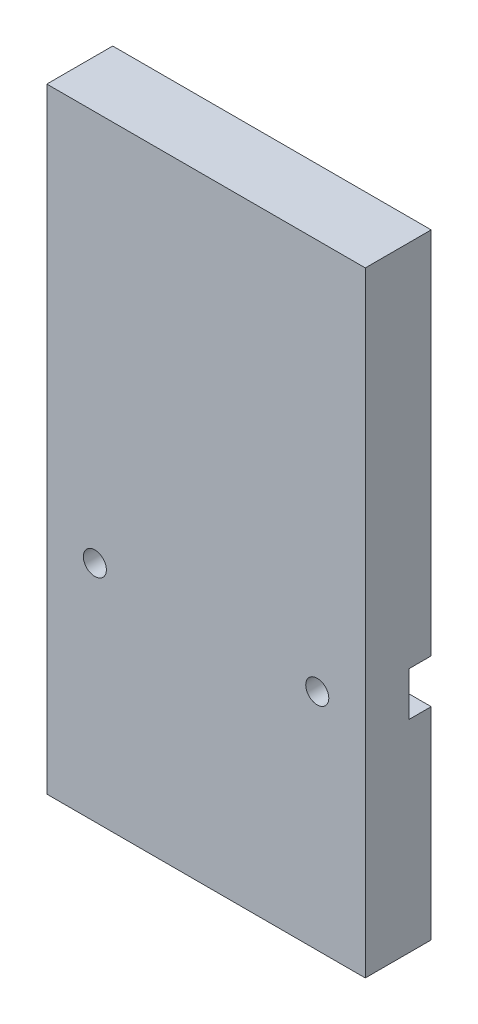
ISO-10303-21;
HEADER;
FILE_DESCRIPTION(('STEP AP214'),'2;1');
FILE_NAME('part.step','',(''),(''),'','','');
FILE_SCHEMA(('AUTOMOTIVE_DESIGN { 1 0 10303 214 1 1 1 1 }'));
ENDSEC;
DATA;
#1=APPLICATION_CONTEXT('core data for automotive mechanical design processes');
#2=APPLICATION_PROTOCOL_DEFINITION('international standard','automotive_design',2000,#1);
#3=PRODUCT_CONTEXT('',#1,'mechanical');
#4=PRODUCT('Part','Part','',(#3));
#5=PRODUCT_RELATED_PRODUCT_CATEGORY('part','',(#4));
#6=PRODUCT_DEFINITION_FORMATION('','',#4);
#7=PRODUCT_DEFINITION_CONTEXT('part definition',#1,'design');
#8=PRODUCT_DEFINITION('design','',#6,#7);
#9=PRODUCT_DEFINITION_SHAPE('','',#8);
#10=(LENGTH_UNIT() NAMED_UNIT(*) SI_UNIT(.MILLI.,.METRE.));
#11=(NAMED_UNIT(*) PLANE_ANGLE_UNIT() SI_UNIT($,.RADIAN.));
#12=(NAMED_UNIT(*) SI_UNIT($,.STERADIAN.) SOLID_ANGLE_UNIT());
#13=UNCERTAINTY_MEASURE_WITH_UNIT(LENGTH_MEASURE(1.E-05),#10,'distance_accuracy_value','');
#14=(GEOMETRIC_REPRESENTATION_CONTEXT(3) GLOBAL_UNCERTAINTY_ASSIGNED_CONTEXT((#13)) GLOBAL_UNIT_ASSIGNED_CONTEXT((#10,
#11,#12)) REPRESENTATION_CONTEXT('',''));
#15=CARTESIAN_POINT('',(0.,0.,0.));
#16=DIRECTION('',(0.,0.,1.));
#17=DIRECTION('',(1.,0.,0.));
#18=AXIS2_PLACEMENT_3D('',#15,#16,#17);
#19=CARTESIAN_POINT('',(0.,355.6,0.));
#20=DIRECTION('',(1.,0.,0.));
#21=DIRECTION('',(0.,0.,-1.));
#22=AXIS2_PLACEMENT_3D('',#19,#20,#21);
#23=PLANE('',#22);
#24=DIRECTION('',(0.,0.,-1.));
#25=VECTOR('',#24,1.);
#26=CARTESIAN_POINT('',(0.,116.84,-25.4));
#27=LINE('',#26,#25);
#28=CARTESIAN_POINT('',(0.,116.84,-25.4));
#29=VERTEX_POINT('',#28);
#30=CARTESIAN_POINT('',(0.,116.84,-38.1));
#31=VERTEX_POINT('',#30);
#32=EDGE_CURVE('E234',#29,#31,#27,.T.);
#33=ORIENTED_EDGE('',*,*,#32,.T.);
#34=DIRECTION('',(0.,-1.,0.));
#35=VECTOR('',#34,1.);
#36=CARTESIAN_POINT('',(0.,355.6,-38.1));
#37=LINE('',#36,#35);
#38=CARTESIAN_POINT('',(0.,0.,-38.1));
#39=VERTEX_POINT('',#38);
#40=EDGE_CURVE('E98',#31,#39,#37,.T.);
#41=ORIENTED_EDGE('',*,*,#40,.T.);
#42=DIRECTION('',(0.,0.,1.));
#43=VECTOR('',#42,1.);
#44=CARTESIAN_POINT('',(0.,0.,0.));
#45=LINE('',#44,#43);
#46=CARTESIAN_POINT('',(0.,0.,0.));
#47=VERTEX_POINT('',#46);
#48=EDGE_CURVE('E236',#39,#47,#45,.T.);
#49=ORIENTED_EDGE('',*,*,#48,.T.);
#50=DIRECTION('',(0.,-1.,0.));
#51=VECTOR('',#50,1.);
#52=CARTESIAN_POINT('',(0.,355.6,0.));
#53=LINE('',#52,#51);
#54=CARTESIAN_POINT('',(0.,355.6,0.));
#55=VERTEX_POINT('',#54);
#56=EDGE_CURVE('E11',#55,#47,#53,.T.);
#57=ORIENTED_EDGE('',*,*,#56,.F.);
#58=DIRECTION('',(0.,0.,1.));
#59=VECTOR('',#58,1.);
#60=CARTESIAN_POINT('',(0.,355.6,0.));
#61=LINE('',#60,#59);
#62=CARTESIAN_POINT('',(0.,355.6,-38.1));
#63=VERTEX_POINT('',#62);
#64=EDGE_CURVE('E237',#63,#55,#61,.T.);
#65=ORIENTED_EDGE('',*,*,#64,.F.);
#66=CARTESIAN_POINT('',(0.,142.24,-38.1));
#67=VERTEX_POINT('',#66);
#68=EDGE_CURVE('E251',#63,#67,#37,.T.);
#69=ORIENTED_EDGE('',*,*,#68,.T.);
#70=DIRECTION('',(0.,0.,-1.));
#71=VECTOR('',#70,1.);
#72=CARTESIAN_POINT('',(0.,142.24,-25.4));
#73=LINE('',#72,#71);
#74=CARTESIAN_POINT('',(0.,142.24,-25.4));
#75=VERTEX_POINT('',#74);
#76=EDGE_CURVE('E67',#75,#67,#73,.T.);
#77=ORIENTED_EDGE('',*,*,#76,.F.);
#78=DIRECTION('',(0.,-1.,0.));
#79=VECTOR('',#78,1.);
#80=CARTESIAN_POINT('',(0.,116.84,-25.4));
#81=LINE('',#80,#79);
#82=EDGE_CURVE('E213',#75,#29,#81,.T.);
#83=ORIENTED_EDGE('',*,*,#82,.T.);
#84=EDGE_LOOP('',(#33,#41,#49,#57,#65,#69,#77,#83));
#85=FACE_BOUND('',#84,.T.);
#86=ADVANCED_FACE('F51',(#85),#23,.F.);
#87=CARTESIAN_POINT('',(184.15,355.6,0.));
#88=DIRECTION('',(-1.,0.,0.));
#89=DIRECTION('',(0.,0.,1.));
#90=AXIS2_PLACEMENT_3D('',#87,#88,#89);
#91=PLANE('',#90);
#92=DIRECTION('',(0.,0.,-1.));
#93=VECTOR('',#92,1.);
#94=CARTESIAN_POINT('',(184.15,116.84,-25.4));
#95=LINE('',#94,#93);
#96=CARTESIAN_POINT('',(184.15,116.84,-25.4));
#97=VERTEX_POINT('',#96);
#98=CARTESIAN_POINT('',(184.15,116.84,-38.1));
#99=VERTEX_POINT('',#98);
#100=EDGE_CURVE('E232',#97,#99,#95,.T.);
#101=ORIENTED_EDGE('',*,*,#100,.F.);
#102=DIRECTION('',(0.,1.,0.));
#103=VECTOR('',#102,1.);
#104=CARTESIAN_POINT('',(184.15,116.84,-25.4));
#105=LINE('',#104,#103);
#106=CARTESIAN_POINT('',(184.15,142.24,-25.4));
#107=VERTEX_POINT('',#106);
#108=EDGE_CURVE('E219',#97,#107,#105,.T.);
#109=ORIENTED_EDGE('',*,*,#108,.T.);
#110=DIRECTION('',(0.,0.,-1.));
#111=VECTOR('',#110,1.);
#112=CARTESIAN_POINT('',(184.15,142.24,-25.4));
#113=LINE('',#112,#111);
#114=CARTESIAN_POINT('',(184.15,142.24,-38.1));
#115=VERTEX_POINT('',#114);
#116=EDGE_CURVE('E229',#107,#115,#113,.T.);
#117=ORIENTED_EDGE('',*,*,#116,.T.);
#118=DIRECTION('',(0.,-1.,0.));
#119=VECTOR('',#118,1.);
#120=CARTESIAN_POINT('',(184.15,355.6,-38.1));
#121=LINE('',#120,#119);
#122=CARTESIAN_POINT('',(184.15,355.6,-38.1));
#123=VERTEX_POINT('',#122);
#124=EDGE_CURVE('E255',#123,#115,#121,.T.);
#125=ORIENTED_EDGE('',*,*,#124,.F.);
#126=DIRECTION('',(0.,0.,-1.));
#127=VECTOR('',#126,1.);
#128=CARTESIAN_POINT('',(184.15,355.6,0.));
#129=LINE('',#128,#127);
#130=CARTESIAN_POINT('',(184.15,355.6,0.));
#131=VERTEX_POINT('',#130);
#132=EDGE_CURVE('E241',#131,#123,#129,.T.);
#133=ORIENTED_EDGE('',*,*,#132,.F.);
#134=DIRECTION('',(0.,-1.,0.));
#135=VECTOR('',#134,1.);
#136=CARTESIAN_POINT('',(184.15,355.6,0.));
#137=LINE('',#136,#135);
#138=CARTESIAN_POINT('',(184.15,0.,0.));
#139=VERTEX_POINT('',#138);
#140=EDGE_CURVE('E59',#131,#139,#137,.T.);
#141=ORIENTED_EDGE('',*,*,#140,.T.);
#142=DIRECTION('',(0.,0.,-1.));
#143=VECTOR('',#142,1.);
#144=CARTESIAN_POINT('',(184.15,0.,0.));
#145=LINE('',#144,#143);
#146=CARTESIAN_POINT('',(184.15,0.,-38.1));
#147=VERTEX_POINT('',#146);
#148=EDGE_CURVE('E247',#139,#147,#145,.T.);
#149=ORIENTED_EDGE('',*,*,#148,.T.);
#150=EDGE_CURVE('E254',#99,#147,#121,.T.);
#151=ORIENTED_EDGE('',*,*,#150,.F.);
#152=EDGE_LOOP('',(#101,#109,#117,#125,#133,#141,#149,#151));
#153=FACE_BOUND('',#152,.T.);
#154=ADVANCED_FACE('F286',(#153),#91,.F.);
#155=CARTESIAN_POINT('',(0.,355.6,-38.1));
#156=DIRECTION('',(0.,0.,1.));
#157=DIRECTION('',(1.,0.,0.));
#158=AXIS2_PLACEMENT_3D('',#155,#156,#157);
#159=PLANE('',#158);
#160=DIRECTION('',(1.,0.,0.));
#161=VECTOR('',#160,1.);
#162=CARTESIAN_POINT('',(0.,116.84,-38.1));
#163=LINE('',#162,#161);
#164=EDGE_CURVE('E224',#31,#99,#163,.T.);
#165=ORIENTED_EDGE('',*,*,#164,.T.);
#166=ORIENTED_EDGE('',*,*,#150,.T.);
#167=DIRECTION('',(-1.,0.,0.));
#168=VECTOR('',#167,1.);
#169=CARTESIAN_POINT('',(0.,0.,-38.1));
#170=LINE('',#169,#168);
#171=EDGE_CURVE('E239',#147,#39,#170,.T.);
#172=ORIENTED_EDGE('',*,*,#171,.T.);
#173=ORIENTED_EDGE('',*,*,#40,.F.);
#174=EDGE_LOOP('',(#165,#166,#172,#173));
#175=FACE_BOUND('',#174,.T.);
#176=ADVANCED_FACE('F292',(#175),#159,.F.);
#177=DIRECTION('',(-1.,0.,0.));
#178=VECTOR('',#177,1.);
#179=CARTESIAN_POINT('',(0.,142.24,-38.1));
#180=LINE('',#179,#178);
#181=EDGE_CURVE('E217',#115,#67,#180,.T.);
#182=ORIENTED_EDGE('',*,*,#181,.T.);
#183=ORIENTED_EDGE('',*,*,#68,.F.);
#184=DIRECTION('',(-1.,0.,0.));
#185=VECTOR('',#184,1.);
#186=CARTESIAN_POINT('',(0.,355.6,-38.1));
#187=LINE('',#186,#185);
#188=EDGE_CURVE('E76',#123,#63,#187,.T.);
#189=ORIENTED_EDGE('',*,*,#188,.F.);
#190=ORIENTED_EDGE('',*,*,#124,.T.);
#191=EDGE_LOOP('',(#182,#183,#189,#190));
#192=FACE_BOUND('',#191,.T.);
#193=ADVANCED_FACE('F282',(#192),#159,.F.);
#194=CARTESIAN_POINT('',(0.,355.6,0.));
#195=DIRECTION('',(0.,0.,-1.));
#196=DIRECTION('',(-1.,0.,0.));
#197=AXIS2_PLACEMENT_3D('',#194,#195,#196);
#198=PLANE('',#197);
#199=CARTESIAN_POINT('',(156.37405606,129.54,0.));
#200=DIRECTION('',(0.,0.,-1.));
#201=DIRECTION('',(-1.,0.,0.));
#202=AXIS2_PLACEMENT_3D('',#199,#200,#201);
#203=CIRCLE('',#202,6.6675);
#204=CARTESIAN_POINT('',(149.70655606,129.54,0.));
#205=VERTEX_POINT('',#204);
#206=EDGE_CURVE('E207',#205,#205,#203,.T.);
#207=ORIENTED_EDGE('',*,*,#206,.T.);
#208=EDGE_LOOP('',(#207));
#209=FACE_BOUND('',#208,.T.);
#210=CARTESIAN_POINT('',(27.77594394,129.54,0.));
#211=DIRECTION('',(0.,0.,-1.));
#212=DIRECTION('',(-1.,0.,0.));
#213=AXIS2_PLACEMENT_3D('',#210,#211,#212);
#214=CIRCLE('',#213,6.66749999999999);
#215=CARTESIAN_POINT('',(21.10844394,129.54,0.));
#216=VERTEX_POINT('',#215);
#217=EDGE_CURVE('E206',#216,#216,#214,.T.);
#218=ORIENTED_EDGE('',*,*,#217,.T.);
#219=EDGE_LOOP('',(#218));
#220=FACE_BOUND('',#219,.T.);
#221=DIRECTION('',(1.,0.,0.));
#222=VECTOR('',#221,1.);
#223=CARTESIAN_POINT('',(0.,0.,0.));
#224=LINE('',#223,#222);
#225=EDGE_CURVE('E245',#47,#139,#224,.T.);
#226=ORIENTED_EDGE('',*,*,#225,.T.);
#227=ORIENTED_EDGE('',*,*,#140,.F.);
#228=DIRECTION('',(1.,0.,0.));
#229=VECTOR('',#228,1.);
#230=CARTESIAN_POINT('',(0.,355.6,0.));
#231=LINE('',#230,#229);
#232=EDGE_CURVE('E105',#55,#131,#231,.T.);
#233=ORIENTED_EDGE('',*,*,#232,.F.);
#234=ORIENTED_EDGE('',*,*,#56,.T.);
#235=EDGE_LOOP('',(#226,#227,#233,#234));
#236=FACE_BOUND('',#235,.T.);
#237=ADVANCED_FACE('F298',(#209,#220,#236),#198,.F.);
#238=CARTESIAN_POINT('',(0.,355.6,0.));
#239=DIRECTION('',(0.,-1.,0.));
#240=DIRECTION('',(0.,0.,-1.));
#241=AXIS2_PLACEMENT_3D('',#238,#239,#240);
#242=PLANE('',#241);
#243=ORIENTED_EDGE('',*,*,#64,.T.);
#244=ORIENTED_EDGE('',*,*,#232,.T.);
#245=ORIENTED_EDGE('',*,*,#132,.T.);
#246=ORIENTED_EDGE('',*,*,#188,.T.);
#247=EDGE_LOOP('',(#243,#244,#245,#246));
#248=FACE_BOUND('',#247,.T.);
#249=ADVANCED_FACE('F299',(#248),#242,.F.);
#250=CARTESIAN_POINT('',(0.,0.,0.));
#251=DIRECTION('',(0.,-1.,0.));
#252=DIRECTION('',(0.,0.,-1.));
#253=AXIS2_PLACEMENT_3D('',#250,#251,#252);
#254=PLANE('',#253);
#255=CARTESIAN_POINT('',(12.7,0.,-19.05));
#256=DIRECTION('',(0.,-1.,0.));
#257=DIRECTION('',(0.,0.,-1.));
#258=AXIS2_PLACEMENT_3D('',#255,#256,#257);
#259=CIRCLE('',#258,2.45744999999999);
#260=CARTESIAN_POINT('',(12.7,0.,-21.50745));
#261=VERTEX_POINT('',#260);
#262=EDGE_CURVE('E160',#261,#261,#259,.T.);
#263=ORIENTED_EDGE('',*,*,#262,.F.);
#264=EDGE_LOOP('',(#263));
#265=FACE_BOUND('',#264,.T.);
#266=CARTESIAN_POINT('',(35.3785714285715,0.,-19.05));
#267=DIRECTION('',(0.,-1.,0.));
#268=DIRECTION('',(0.,0.,-1.));
#269=AXIS2_PLACEMENT_3D('',#266,#267,#268);
#270=CIRCLE('',#269,2.45744999999999);
#271=CARTESIAN_POINT('',(35.3785714285715,0.,-21.50745));
#272=VERTEX_POINT('',#271);
#273=EDGE_CURVE('E159',#272,#272,#270,.T.);
#274=ORIENTED_EDGE('',*,*,#273,.F.);
#275=EDGE_LOOP('',(#274));
#276=FACE_BOUND('',#275,.T.);
#277=CARTESIAN_POINT('',(58.0571428571429,0.,-19.05));
#278=DIRECTION('',(0.,-1.,0.));
#279=DIRECTION('',(0.,0.,-1.));
#280=AXIS2_PLACEMENT_3D('',#277,#278,#279);
#281=CIRCLE('',#280,2.45744999999999);
#282=CARTESIAN_POINT('',(58.0571428571429,0.,-21.50745));
#283=VERTEX_POINT('',#282);
#284=EDGE_CURVE('E170',#283,#283,#281,.T.);
#285=ORIENTED_EDGE('',*,*,#284,.F.);
#286=EDGE_LOOP('',(#285));
#287=FACE_BOUND('',#286,.T.);
#288=CARTESIAN_POINT('',(80.7357142857143,0.,-19.05));
#289=DIRECTION('',(0.,-1.,0.));
#290=DIRECTION('',(0.,0.,-1.));
#291=AXIS2_PLACEMENT_3D('',#288,#289,#290);
#292=CIRCLE('',#291,2.45744999999999);
#293=CARTESIAN_POINT('',(80.7357142857143,0.,-21.50745));
#294=VERTEX_POINT('',#293);
#295=EDGE_CURVE('E176',#294,#294,#292,.T.);
#296=ORIENTED_EDGE('',*,*,#295,.F.);
#297=EDGE_LOOP('',(#296));
#298=FACE_BOUND('',#297,.T.);
#299=CARTESIAN_POINT('',(103.414285714286,0.,-19.05));
#300=DIRECTION('',(0.,-1.,0.));
#301=DIRECTION('',(0.,0.,-1.));
#302=AXIS2_PLACEMENT_3D('',#299,#300,#301);
#303=CIRCLE('',#302,2.45744999999999);
#304=CARTESIAN_POINT('',(103.414285714286,0.,-21.50745));
#305=VERTEX_POINT('',#304);
#306=EDGE_CURVE('E182',#305,#305,#303,.T.);
#307=ORIENTED_EDGE('',*,*,#306,.F.);
#308=EDGE_LOOP('',(#307));
#309=FACE_BOUND('',#308,.T.);
#310=CARTESIAN_POINT('',(126.092857142857,0.,-19.05));
#311=DIRECTION('',(0.,-1.,0.));
#312=DIRECTION('',(0.,0.,-1.));
#313=AXIS2_PLACEMENT_3D('',#310,#311,#312);
#314=CIRCLE('',#313,2.45745);
#315=CARTESIAN_POINT('',(126.092857142857,0.,-21.50745));
#316=VERTEX_POINT('',#315);
#317=EDGE_CURVE('E188',#316,#316,#314,.T.);
#318=ORIENTED_EDGE('',*,*,#317,.F.);
#319=EDGE_LOOP('',(#318));
#320=FACE_BOUND('',#319,.T.);
#321=CARTESIAN_POINT('',(148.771428571429,0.,-19.05));
#322=DIRECTION('',(0.,-1.,0.));
#323=DIRECTION('',(0.,0.,-1.));
#324=AXIS2_PLACEMENT_3D('',#321,#322,#323);
#325=CIRCLE('',#324,2.45745);
#326=CARTESIAN_POINT('',(148.771428571429,0.,-21.50745));
#327=VERTEX_POINT('',#326);
#328=EDGE_CURVE('E194',#327,#327,#325,.T.);
#329=ORIENTED_EDGE('',*,*,#328,.F.);
#330=EDGE_LOOP('',(#329));
#331=FACE_BOUND('',#330,.T.);
#332=CARTESIAN_POINT('',(171.45,0.,-19.05));
#333=DIRECTION('',(0.,-1.,0.));
#334=DIRECTION('',(0.,0.,-1.));
#335=AXIS2_PLACEMENT_3D('',#332,#333,#334);
#336=CIRCLE('',#335,2.45745);
#337=CARTESIAN_POINT('',(171.45,0.,-21.50745));
#338=VERTEX_POINT('',#337);
#339=EDGE_CURVE('E200',#338,#338,#336,.T.);
#340=ORIENTED_EDGE('',*,*,#339,.F.);
#341=EDGE_LOOP('',(#340));
#342=FACE_BOUND('',#341,.T.);
#343=ORIENTED_EDGE('',*,*,#48,.F.);
#344=ORIENTED_EDGE('',*,*,#171,.F.);
#345=ORIENTED_EDGE('',*,*,#148,.F.);
#346=ORIENTED_EDGE('',*,*,#225,.F.);
#347=EDGE_LOOP('',(#343,#344,#345,#346));
#348=FACE_BOUND('',#347,.T.);
#349=ADVANCED_FACE('F297',(#265,#276,#287,#298,#309,#320,#331,#342,#348),#254,.T.);
#350=CARTESIAN_POINT('',(0.,116.84,-25.4));
#351=DIRECTION('',(0.,1.,0.));
#352=DIRECTION('',(0.,0.,1.));
#353=AXIS2_PLACEMENT_3D('',#350,#351,#352);
#354=PLANE('',#353);
#355=ORIENTED_EDGE('',*,*,#164,.F.);
#356=ORIENTED_EDGE('',*,*,#32,.F.);
#357=DIRECTION('',(1.,0.,0.));
#358=VECTOR('',#357,1.);
#359=CARTESIAN_POINT('',(0.,116.84,-25.4));
#360=LINE('',#359,#358);
#361=EDGE_CURVE('E216',#29,#97,#360,.T.);
#362=ORIENTED_EDGE('',*,*,#361,.T.);
#363=ORIENTED_EDGE('',*,*,#100,.T.);
#364=EDGE_LOOP('',(#355,#356,#362,#363));
#365=FACE_BOUND('',#364,.T.);
#366=ADVANCED_FACE('F290',(#365),#354,.T.);
#367=CARTESIAN_POINT('',(0.,142.24,-25.4));
#368=DIRECTION('',(0.,-1.,0.));
#369=DIRECTION('',(0.,0.,-1.));
#370=AXIS2_PLACEMENT_3D('',#367,#368,#369);
#371=PLANE('',#370);
#372=ORIENTED_EDGE('',*,*,#181,.F.);
#373=ORIENTED_EDGE('',*,*,#116,.F.);
#374=DIRECTION('',(-1.,0.,0.));
#375=VECTOR('',#374,1.);
#376=CARTESIAN_POINT('',(0.,142.24,-25.4));
#377=LINE('',#376,#375);
#378=EDGE_CURVE('E222',#107,#75,#377,.T.);
#379=ORIENTED_EDGE('',*,*,#378,.T.);
#380=ORIENTED_EDGE('',*,*,#76,.T.);
#381=EDGE_LOOP('',(#372,#373,#379,#380));
#382=FACE_BOUND('',#381,.T.);
#383=ADVANCED_FACE('F272',(#382),#371,.T.);
#384=CARTESIAN_POINT('',(0.,0.,-25.4));
#385=DIRECTION('',(0.,0.,-1.));
#386=DIRECTION('',(-1.,0.,0.));
#387=AXIS2_PLACEMENT_3D('',#384,#385,#386);
#388=PLANE('',#387);
#389=CARTESIAN_POINT('',(156.37405606,129.54,-25.4));
#390=DIRECTION('',(0.,0.,-1.));
#391=DIRECTION('',(-1.,0.,0.));
#392=AXIS2_PLACEMENT_3D('',#389,#390,#391);
#393=CIRCLE('',#392,6.6675);
#394=CARTESIAN_POINT('',(149.70655606,129.54,-25.4));
#395=VERTEX_POINT('',#394);
#396=EDGE_CURVE('E54',#395,#395,#393,.T.);
#397=ORIENTED_EDGE('',*,*,#396,.F.);
#398=EDGE_LOOP('',(#397));
#399=FACE_BOUND('',#398,.T.);
#400=CARTESIAN_POINT('',(27.77594394,129.54,-25.4));
#401=DIRECTION('',(0.,0.,-1.));
#402=DIRECTION('',(-1.,0.,0.));
#403=AXIS2_PLACEMENT_3D('',#400,#401,#402);
#404=CIRCLE('',#403,6.66749999999999);
#405=CARTESIAN_POINT('',(21.10844394,129.54,-25.4));
#406=VERTEX_POINT('',#405);
#407=EDGE_CURVE('E210',#406,#406,#404,.T.);
#408=ORIENTED_EDGE('',*,*,#407,.F.);
#409=EDGE_LOOP('',(#408));
#410=FACE_BOUND('',#409,.T.);
#411=ORIENTED_EDGE('',*,*,#82,.F.);
#412=ORIENTED_EDGE('',*,*,#378,.F.);
#413=ORIENTED_EDGE('',*,*,#108,.F.);
#414=ORIENTED_EDGE('',*,*,#361,.F.);
#415=EDGE_LOOP('',(#411,#412,#413,#414));
#416=FACE_BOUND('',#415,.T.);
#417=ADVANCED_FACE('F268',(#399,#410,#416),#388,.T.);
#418=CARTESIAN_POINT('',(27.77594394,129.54,0.));
#419=DIRECTION('',(0.,0.,-1.));
#420=DIRECTION('',(-1.,0.,0.));
#421=AXIS2_PLACEMENT_3D('',#418,#419,#420);
#422=CYLINDRICAL_SURFACE('',#421,6.66749999999999);
#423=ORIENTED_EDGE('',*,*,#407,.T.);
#424=EDGE_LOOP('',(#423));
#425=FACE_BOUND('',#424,.T.);
#426=ORIENTED_EDGE('',*,*,#217,.F.);
#427=EDGE_LOOP('',(#426));
#428=FACE_BOUND('',#427,.T.);
#429=ADVANCED_FACE('F271',(#425,#428),#422,.F.);
#430=CARTESIAN_POINT('',(156.37405606,129.54,0.));
#431=DIRECTION('',(0.,0.,-1.));
#432=DIRECTION('',(-1.,0.,0.));
#433=AXIS2_PLACEMENT_3D('',#430,#431,#432);
#434=CYLINDRICAL_SURFACE('',#433,6.6675);
#435=ORIENTED_EDGE('',*,*,#396,.T.);
#436=EDGE_LOOP('',(#435));
#437=FACE_BOUND('',#436,.T.);
#438=ORIENTED_EDGE('',*,*,#206,.F.);
#439=EDGE_LOOP('',(#438));
#440=FACE_BOUND('',#439,.T.);
#441=ADVANCED_FACE('F265',(#437,#440),#434,.F.);
#442=CARTESIAN_POINT('',(171.45,76.2,-19.05));
#443=DIRECTION('',(0.,-1.,0.));
#444=DIRECTION('',(0.,0.,-1.));
#445=AXIS2_PLACEMENT_3D('',#442,#443,#444);
#446=CONICAL_SURFACE('',#445,2.45744999999997,1.02974425867664);
#447=CARTESIAN_POINT('',(171.45,77.6765849282293,-19.05));
#448=VERTEX_POINT('',#447);
#449=VERTEX_LOOP('',#448);
#450=FACE_BOUND('',#449,.T.);
#451=CARTESIAN_POINT('',(171.45,76.2,-19.05));
#452=DIRECTION('',(0.,-1.,0.));
#453=DIRECTION('',(0.,0.,-1.));
#454=AXIS2_PLACEMENT_3D('',#451,#452,#453);
#455=CIRCLE('',#454,2.45744999999997);
#456=CARTESIAN_POINT('',(171.45,76.2,-21.50745));
#457=VERTEX_POINT('',#456);
#458=EDGE_CURVE('E203',#457,#457,#455,.T.);
#459=ORIENTED_EDGE('',*,*,#458,.T.);
#460=EDGE_LOOP('',(#459));
#461=FACE_BOUND('',#460,.T.);
#462=ADVANCED_FACE('F361',(#450,#461),#446,.F.);
#463=CARTESIAN_POINT('',(171.45,0.,-19.05));
#464=DIRECTION('',(0.,-1.,0.));
#465=DIRECTION('',(0.,0.,-1.));
#466=AXIS2_PLACEMENT_3D('',#463,#464,#465);
#467=CYLINDRICAL_SURFACE('',#466,2.45744999999999);
#468=ORIENTED_EDGE('',*,*,#458,.F.);
#469=EDGE_LOOP('',(#468));
#470=FACE_BOUND('',#469,.T.);
#471=ORIENTED_EDGE('',*,*,#339,.T.);
#472=EDGE_LOOP('',(#471));
#473=FACE_BOUND('',#472,.T.);
#474=ADVANCED_FACE('F374',(#470,#473),#467,.F.);
#475=CARTESIAN_POINT('',(148.771428571429,76.2,-19.05));
#476=DIRECTION('',(0.,-1.,0.));
#477=DIRECTION('',(0.,0.,-1.));
#478=AXIS2_PLACEMENT_3D('',#475,#476,#477);
#479=CONICAL_SURFACE('',#478,2.45744999999997,1.02974425867664);
#480=CARTESIAN_POINT('',(148.771428571429,77.6765849282293,-19.05));
#481=VERTEX_POINT('',#480);
#482=VERTEX_LOOP('',#481);
#483=FACE_BOUND('',#482,.T.);
#484=CARTESIAN_POINT('',(148.771428571429,76.2,-19.05));
#485=DIRECTION('',(0.,-1.,0.));
#486=DIRECTION('',(0.,0.,-1.));
#487=AXIS2_PLACEMENT_3D('',#484,#485,#486);
#488=CIRCLE('',#487,2.45744999999997);
#489=CARTESIAN_POINT('',(148.771428571429,76.2,-21.50745));
#490=VERTEX_POINT('',#489);
#491=EDGE_CURVE('E197',#490,#490,#488,.T.);
#492=ORIENTED_EDGE('',*,*,#491,.T.);
#493=EDGE_LOOP('',(#492));
#494=FACE_BOUND('',#493,.T.);
#495=ADVANCED_FACE('F383',(#483,#494),#479,.F.);
#496=CARTESIAN_POINT('',(148.771428571429,0.,-19.05));
#497=DIRECTION('',(0.,-1.,0.));
#498=DIRECTION('',(0.,0.,-1.));
#499=AXIS2_PLACEMENT_3D('',#496,#497,#498);
#500=CYLINDRICAL_SURFACE('',#499,2.45744999999999);
#501=ORIENTED_EDGE('',*,*,#491,.F.);
#502=EDGE_LOOP('',(#501));
#503=FACE_BOUND('',#502,.T.);
#504=ORIENTED_EDGE('',*,*,#328,.T.);
#505=EDGE_LOOP('',(#504));
#506=FACE_BOUND('',#505,.T.);
#507=ADVANCED_FACE('F392',(#503,#506),#500,.F.);
#508=CARTESIAN_POINT('',(126.092857142857,76.2,-19.05));
#509=DIRECTION('',(0.,-1.,0.));
#510=DIRECTION('',(0.,0.,-1.));
#511=AXIS2_PLACEMENT_3D('',#508,#509,#510);
#512=CONICAL_SURFACE('',#511,2.45744999999997,1.02974425867664);
#513=CARTESIAN_POINT('',(126.092857142857,77.6765849282293,-19.05));
#514=VERTEX_POINT('',#513);
#515=VERTEX_LOOP('',#514);
#516=FACE_BOUND('',#515,.T.);
#517=CARTESIAN_POINT('',(126.092857142857,76.2,-19.05));
#518=DIRECTION('',(0.,-1.,0.));
#519=DIRECTION('',(0.,0.,-1.));
#520=AXIS2_PLACEMENT_3D('',#517,#518,#519);
#521=CIRCLE('',#520,2.45744999999997);
#522=CARTESIAN_POINT('',(126.092857142857,76.2,-21.50745));
#523=VERTEX_POINT('',#522);
#524=EDGE_CURVE('E191',#523,#523,#521,.T.);
#525=ORIENTED_EDGE('',*,*,#524,.T.);
#526=EDGE_LOOP('',(#525));
#527=FACE_BOUND('',#526,.T.);
#528=ADVANCED_FACE('F401',(#516,#527),#512,.F.);
#529=CARTESIAN_POINT('',(126.092857142857,0.,-19.05));
#530=DIRECTION('',(0.,-1.,0.));
#531=DIRECTION('',(0.,0.,-1.));
#532=AXIS2_PLACEMENT_3D('',#529,#530,#531);
#533=CYLINDRICAL_SURFACE('',#532,2.45744999999999);
#534=ORIENTED_EDGE('',*,*,#524,.F.);
#535=EDGE_LOOP('',(#534));
#536=FACE_BOUND('',#535,.T.);
#537=ORIENTED_EDGE('',*,*,#317,.T.);
#538=EDGE_LOOP('',(#537));
#539=FACE_BOUND('',#538,.T.);
#540=ADVANCED_FACE('F410',(#536,#539),#533,.F.);
#541=CARTESIAN_POINT('',(103.414285714286,76.2,-19.05));
#542=DIRECTION('',(0.,-1.,0.));
#543=DIRECTION('',(0.,0.,-1.));
#544=AXIS2_PLACEMENT_3D('',#541,#542,#543);
#545=CONICAL_SURFACE('',#544,2.45744999999997,1.02974425867664);
#546=CARTESIAN_POINT('',(103.414285714286,77.6765849282293,-19.05));
#547=VERTEX_POINT('',#546);
#548=VERTEX_LOOP('',#547);
#549=FACE_BOUND('',#548,.T.);
#550=CARTESIAN_POINT('',(103.414285714286,76.2,-19.05));
#551=DIRECTION('',(0.,-1.,0.));
#552=DIRECTION('',(0.,0.,-1.));
#553=AXIS2_PLACEMENT_3D('',#550,#551,#552);
#554=CIRCLE('',#553,2.45744999999997);
#555=CARTESIAN_POINT('',(103.414285714286,76.2,-21.50745));
#556=VERTEX_POINT('',#555);
#557=EDGE_CURVE('E185',#556,#556,#554,.T.);
#558=ORIENTED_EDGE('',*,*,#557,.T.);
#559=EDGE_LOOP('',(#558));
#560=FACE_BOUND('',#559,.T.);
#561=ADVANCED_FACE('F419',(#549,#560),#545,.F.);
#562=CARTESIAN_POINT('',(103.414285714286,0.,-19.05));
#563=DIRECTION('',(0.,-1.,0.));
#564=DIRECTION('',(0.,0.,-1.));
#565=AXIS2_PLACEMENT_3D('',#562,#563,#564);
#566=CYLINDRICAL_SURFACE('',#565,2.45744999999998);
#567=ORIENTED_EDGE('',*,*,#557,.F.);
#568=EDGE_LOOP('',(#567));
#569=FACE_BOUND('',#568,.T.);
#570=ORIENTED_EDGE('',*,*,#306,.T.);
#571=EDGE_LOOP('',(#570));
#572=FACE_BOUND('',#571,.T.);
#573=ADVANCED_FACE('F428',(#569,#572),#566,.F.);
#574=CARTESIAN_POINT('',(80.7357142857143,76.2,-19.05));
#575=DIRECTION('',(0.,-1.,0.));
#576=DIRECTION('',(0.,0.,-1.));
#577=AXIS2_PLACEMENT_3D('',#574,#575,#576);
#578=CONICAL_SURFACE('',#577,2.45744999999997,1.02974425867664);
#579=CARTESIAN_POINT('',(80.7357142857143,77.6765849282293,-19.05));
#580=VERTEX_POINT('',#579);
#581=VERTEX_LOOP('',#580);
#582=FACE_BOUND('',#581,.T.);
#583=CARTESIAN_POINT('',(80.7357142857143,76.2,-19.05));
#584=DIRECTION('',(0.,-1.,0.));
#585=DIRECTION('',(0.,0.,-1.));
#586=AXIS2_PLACEMENT_3D('',#583,#584,#585);
#587=CIRCLE('',#586,2.45744999999997);
#588=CARTESIAN_POINT('',(80.7357142857143,76.2,-21.50745));
#589=VERTEX_POINT('',#588);
#590=EDGE_CURVE('E179',#589,#589,#587,.T.);
#591=ORIENTED_EDGE('',*,*,#590,.T.);
#592=EDGE_LOOP('',(#591));
#593=FACE_BOUND('',#592,.T.);
#594=ADVANCED_FACE('F437',(#582,#593),#578,.F.);
#595=CARTESIAN_POINT('',(80.7357142857143,0.,-19.05));
#596=DIRECTION('',(0.,-1.,0.));
#597=DIRECTION('',(0.,0.,-1.));
#598=AXIS2_PLACEMENT_3D('',#595,#596,#597);
#599=CYLINDRICAL_SURFACE('',#598,2.45744999999998);
#600=ORIENTED_EDGE('',*,*,#590,.F.);
#601=EDGE_LOOP('',(#600));
#602=FACE_BOUND('',#601,.T.);
#603=ORIENTED_EDGE('',*,*,#295,.T.);
#604=EDGE_LOOP('',(#603));
#605=FACE_BOUND('',#604,.T.);
#606=ADVANCED_FACE('F446',(#602,#605),#599,.F.);
#607=CARTESIAN_POINT('',(58.0571428571429,76.2,-19.05));
#608=DIRECTION('',(0.,-1.,0.));
#609=DIRECTION('',(0.,0.,-1.));
#610=AXIS2_PLACEMENT_3D('',#607,#608,#609);
#611=CONICAL_SURFACE('',#610,2.45744999999997,1.02974425867664);
#612=CARTESIAN_POINT('',(58.0571428571429,77.6765849282293,-19.05));
#613=VERTEX_POINT('',#612);
#614=VERTEX_LOOP('',#613);
#615=FACE_BOUND('',#614,.T.);
#616=CARTESIAN_POINT('',(58.0571428571429,76.2,-19.05));
#617=DIRECTION('',(0.,-1.,0.));
#618=DIRECTION('',(0.,0.,-1.));
#619=AXIS2_PLACEMENT_3D('',#616,#617,#618);
#620=CIRCLE('',#619,2.45744999999997);
#621=CARTESIAN_POINT('',(58.0571428571429,76.2,-21.50745));
#622=VERTEX_POINT('',#621);
#623=EDGE_CURVE('E173',#622,#622,#620,.T.);
#624=ORIENTED_EDGE('',*,*,#623,.T.);
#625=EDGE_LOOP('',(#624));
#626=FACE_BOUND('',#625,.T.);
#627=ADVANCED_FACE('F455',(#615,#626),#611,.F.);
#628=CARTESIAN_POINT('',(58.0571428571429,0.,-19.05));
#629=DIRECTION('',(0.,-1.,0.));
#630=DIRECTION('',(0.,0.,-1.));
#631=AXIS2_PLACEMENT_3D('',#628,#629,#630);
#632=CYLINDRICAL_SURFACE('',#631,2.45744999999998);
#633=ORIENTED_EDGE('',*,*,#623,.F.);
#634=EDGE_LOOP('',(#633));
#635=FACE_BOUND('',#634,.T.);
#636=ORIENTED_EDGE('',*,*,#284,.T.);
#637=EDGE_LOOP('',(#636));
#638=FACE_BOUND('',#637,.T.);
#639=ADVANCED_FACE('F464',(#635,#638),#632,.F.);
#640=CARTESIAN_POINT('',(35.3785714285715,76.2,-19.05));
#641=DIRECTION('',(0.,-1.,0.));
#642=DIRECTION('',(0.,0.,-1.));
#643=AXIS2_PLACEMENT_3D('',#640,#641,#642);
#644=CONICAL_SURFACE('',#643,2.45744999999997,1.02974425867664);
#645=CARTESIAN_POINT('',(35.3785714285715,77.6765849282293,-19.05));
#646=VERTEX_POINT('',#645);
#647=VERTEX_LOOP('',#646);
#648=FACE_BOUND('',#647,.T.);
#649=CARTESIAN_POINT('',(35.3785714285715,76.2,-19.05));
#650=DIRECTION('',(0.,-1.,0.));
#651=DIRECTION('',(0.,0.,-1.));
#652=AXIS2_PLACEMENT_3D('',#649,#650,#651);
#653=CIRCLE('',#652,2.45744999999997);
#654=CARTESIAN_POINT('',(35.3785714285715,76.2,-21.50745));
#655=VERTEX_POINT('',#654);
#656=EDGE_CURVE('E163',#655,#655,#653,.T.);
#657=ORIENTED_EDGE('',*,*,#656,.T.);
#658=EDGE_LOOP('',(#657));
#659=FACE_BOUND('',#658,.T.);
#660=ADVANCED_FACE('F473',(#648,#659),#644,.F.);
#661=CARTESIAN_POINT('',(35.3785714285715,0.,-19.05));
#662=DIRECTION('',(0.,-1.,0.));
#663=DIRECTION('',(0.,0.,-1.));
#664=AXIS2_PLACEMENT_3D('',#661,#662,#663);
#665=CYLINDRICAL_SURFACE('',#664,2.45744999999998);
#666=ORIENTED_EDGE('',*,*,#656,.F.);
#667=EDGE_LOOP('',(#666));
#668=FACE_BOUND('',#667,.T.);
#669=ORIENTED_EDGE('',*,*,#273,.T.);
#670=EDGE_LOOP('',(#669));
#671=FACE_BOUND('',#670,.T.);
#672=ADVANCED_FACE('F153',(#668,#671),#665,.F.);
#673=CARTESIAN_POINT('',(12.7,76.2,-19.05));
#674=DIRECTION('',(0.,-1.,0.));
#675=DIRECTION('',(0.,0.,-1.));
#676=AXIS2_PLACEMENT_3D('',#673,#674,#675);
#677=CONICAL_SURFACE('',#676,2.45744999999998,1.02974425867664);
#678=CARTESIAN_POINT('',(12.7,77.6765849282293,-19.05));
#679=VERTEX_POINT('',#678);
#680=VERTEX_LOOP('',#679);
#681=FACE_BOUND('',#680,.T.);
#682=CARTESIAN_POINT('',(12.7,76.2,-19.05));
#683=DIRECTION('',(0.,-1.,0.));
#684=DIRECTION('',(0.,0.,-1.));
#685=AXIS2_PLACEMENT_3D('',#682,#683,#684);
#686=CIRCLE('',#685,2.45744999999998);
#687=CARTESIAN_POINT('',(12.7,76.2,-21.50745));
#688=VERTEX_POINT('',#687);
#689=EDGE_CURVE('E157',#688,#688,#686,.T.);
#690=ORIENTED_EDGE('',*,*,#689,.T.);
#691=EDGE_LOOP('',(#690));
#692=FACE_BOUND('',#691,.T.);
#693=ADVANCED_FACE('F149',(#681,#692),#677,.F.);
#694=CARTESIAN_POINT('',(12.7,0.,-19.05));
#695=DIRECTION('',(0.,-1.,0.));
#696=DIRECTION('',(0.,0.,-1.));
#697=AXIS2_PLACEMENT_3D('',#694,#695,#696);
#698=CYLINDRICAL_SURFACE('',#697,2.45744999999998);
#699=ORIENTED_EDGE('',*,*,#689,.F.);
#700=EDGE_LOOP('',(#699));
#701=FACE_BOUND('',#700,.T.);
#702=ORIENTED_EDGE('',*,*,#262,.T.);
#703=EDGE_LOOP('',(#702));
#704=FACE_BOUND('',#703,.T.);
#705=ADVANCED_FACE('F152',(#701,#704),#698,.F.);
#706=CLOSED_SHELL('',(#86,#154,#176,#193,#237,#249,#349,#366,#383,#417,#429,#441,#462,#474,#495,
#507,#528,#540,#561,#573,#594,#606,#627,#639,#660,#672,#693,#705));
#707=MANIFOLD_SOLID_BREP('B2',#706);
#708=ADVANCED_BREP_SHAPE_REPRESENTATION('',(#18,#707),#14);
#709=SHAPE_DEFINITION_REPRESENTATION(#9,#708);
ENDSEC;
END-ISO-10303-21;
